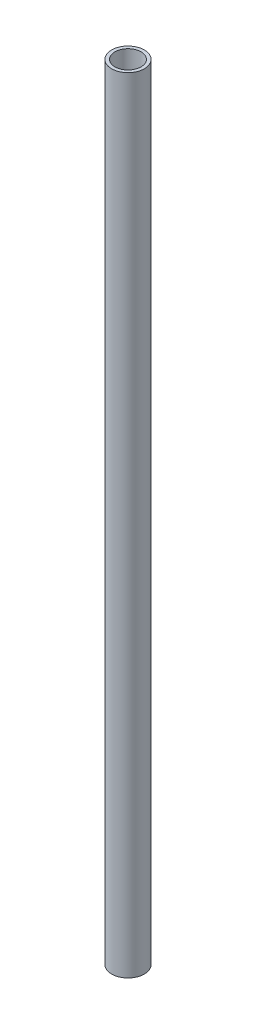
ISO-10303-21;
HEADER;
FILE_DESCRIPTION(('STEP AP214'),'2;1');
FILE_NAME('part.step','',(''),(''),'','','');
FILE_SCHEMA(('AUTOMOTIVE_DESIGN { 1 0 10303 214 1 1 1 1 }'));
ENDSEC;
DATA;
#1=APPLICATION_CONTEXT('core data for automotive mechanical design processes');
#2=APPLICATION_PROTOCOL_DEFINITION('international standard','automotive_design',2000,#1);
#3=PRODUCT_CONTEXT('',#1,'mechanical');
#4=PRODUCT('Part','Part','',(#3));
#5=PRODUCT_RELATED_PRODUCT_CATEGORY('part','',(#4));
#6=PRODUCT_DEFINITION_FORMATION('','',#4);
#7=PRODUCT_DEFINITION_CONTEXT('part definition',#1,'design');
#8=PRODUCT_DEFINITION('design','',#6,#7);
#9=PRODUCT_DEFINITION_SHAPE('','',#8);
#10=(LENGTH_UNIT() NAMED_UNIT(*) SI_UNIT(.MILLI.,.METRE.));
#11=(NAMED_UNIT(*) PLANE_ANGLE_UNIT() SI_UNIT($,.RADIAN.));
#12=(NAMED_UNIT(*) SI_UNIT($,.STERADIAN.) SOLID_ANGLE_UNIT());
#13=UNCERTAINTY_MEASURE_WITH_UNIT(LENGTH_MEASURE(1.E-05),#10,'distance_accuracy_value','');
#14=(GEOMETRIC_REPRESENTATION_CONTEXT(3) GLOBAL_UNCERTAINTY_ASSIGNED_CONTEXT((#13)) GLOBAL_UNIT_ASSIGNED_CONTEXT((#10,
#11,#12)) REPRESENTATION_CONTEXT('',''));
#15=CARTESIAN_POINT('',(0.,0.,0.));
#16=DIRECTION('',(0.,0.,1.));
#17=DIRECTION('',(1.,0.,0.));
#18=AXIS2_PLACEMENT_3D('',#15,#16,#17);
#19=CARTESIAN_POINT('',(0.,120.,0.));
#20=DIRECTION('',(0.,1.,0.));
#21=DIRECTION('',(0.,0.,1.));
#22=AXIS2_PLACEMENT_3D('',#19,#20,#21);
#23=PLANE('',#22);
#24=CARTESIAN_POINT('',(0.,120.,0.));
#25=DIRECTION('',(0.,1.,0.));
#26=DIRECTION('',(0.,0.,1.));
#27=AXIS2_PLACEMENT_3D('',#24,#25,#26);
#28=CIRCLE('',#27,5.);
#29=CARTESIAN_POINT('',(0.,120.,5.));
#30=VERTEX_POINT('',#29);
#31=EDGE_CURVE('E10',#30,#30,#28,.T.);
#32=ORIENTED_EDGE('',*,*,#31,.T.);
#33=EDGE_LOOP('',(#32));
#34=FACE_BOUND('',#33,.T.);
#35=CARTESIAN_POINT('',(0.,120.,0.));
#36=DIRECTION('',(0.,1.,0.));
#37=DIRECTION('',(0.,0.,1.));
#38=AXIS2_PLACEMENT_3D('',#35,#36,#37);
#39=CIRCLE('',#38,4.);
#40=CARTESIAN_POINT('',(0.,120.,4.));
#41=VERTEX_POINT('',#40);
#42=EDGE_CURVE('E47',#41,#41,#39,.T.);
#43=ORIENTED_EDGE('',*,*,#42,.F.);
#44=EDGE_LOOP('',(#43));
#45=FACE_BOUND('',#44,.T.);
#46=ADVANCED_FACE('F36',(#34,#45),#23,.T.);
#47=CARTESIAN_POINT('',(0.,-120.,0.));
#48=DIRECTION('',(0.,1.,0.));
#49=DIRECTION('',(0.,0.,1.));
#50=AXIS2_PLACEMENT_3D('',#47,#48,#49);
#51=PLANE('',#50);
#52=CARTESIAN_POINT('',(0.,-120.,0.));
#53=DIRECTION('',(0.,1.,0.));
#54=DIRECTION('',(0.,0.,1.));
#55=AXIS2_PLACEMENT_3D('',#52,#53,#54);
#56=CIRCLE('',#55,5.);
#57=CARTESIAN_POINT('',(0.,-120.,5.));
#58=VERTEX_POINT('',#57);
#59=EDGE_CURVE('E40',#58,#58,#56,.T.);
#60=ORIENTED_EDGE('',*,*,#59,.F.);
#61=EDGE_LOOP('',(#60));
#62=FACE_BOUND('',#61,.T.);
#63=CARTESIAN_POINT('',(0.,-120.,0.));
#64=DIRECTION('',(0.,1.,0.));
#65=DIRECTION('',(0.,0.,1.));
#66=AXIS2_PLACEMENT_3D('',#63,#64,#65);
#67=CIRCLE('',#66,4.);
#68=CARTESIAN_POINT('',(0.,-120.,4.));
#69=VERTEX_POINT('',#68);
#70=EDGE_CURVE('E49',#69,#69,#67,.T.);
#71=ORIENTED_EDGE('',*,*,#70,.T.);
#72=EDGE_LOOP('',(#71));
#73=FACE_BOUND('',#72,.T.);
#74=ADVANCED_FACE('F59',(#62,#73),#51,.F.);
#75=CARTESIAN_POINT('',(0.,120.,0.));
#76=DIRECTION('',(0.,-1.,0.));
#77=DIRECTION('',(0.,0.,-1.));
#78=AXIS2_PLACEMENT_3D('',#75,#76,#77);
#79=CYLINDRICAL_SURFACE('',#78,5.);
#80=ORIENTED_EDGE('',*,*,#31,.F.);
#81=EDGE_LOOP('',(#80));
#82=FACE_BOUND('',#81,.T.);
#83=ORIENTED_EDGE('',*,*,#59,.T.);
#84=EDGE_LOOP('',(#83));
#85=FACE_BOUND('',#84,.T.);
#86=ADVANCED_FACE('F38',(#82,#85),#79,.T.);
#87=CARTESIAN_POINT('',(0.,120.,0.));
#88=DIRECTION('',(0.,-1.,0.));
#89=DIRECTION('',(0.,0.,-1.));
#90=AXIS2_PLACEMENT_3D('',#87,#88,#89);
#91=CYLINDRICAL_SURFACE('',#90,4.);
#92=ORIENTED_EDGE('',*,*,#42,.T.);
#93=EDGE_LOOP('',(#92));
#94=FACE_BOUND('',#93,.T.);
#95=ORIENTED_EDGE('',*,*,#70,.F.);
#96=EDGE_LOOP('',(#95));
#97=FACE_BOUND('',#96,.T.);
#98=ADVANCED_FACE('F55',(#94,#97),#91,.F.);
#99=CLOSED_SHELL('',(#46,#74,#86,#98));
#100=MANIFOLD_SOLID_BREP('B2',#99);
#101=ADVANCED_BREP_SHAPE_REPRESENTATION('',(#18,#100),#14);
#102=SHAPE_DEFINITION_REPRESENTATION(#9,#101);
ENDSEC;
END-ISO-10303-21;
